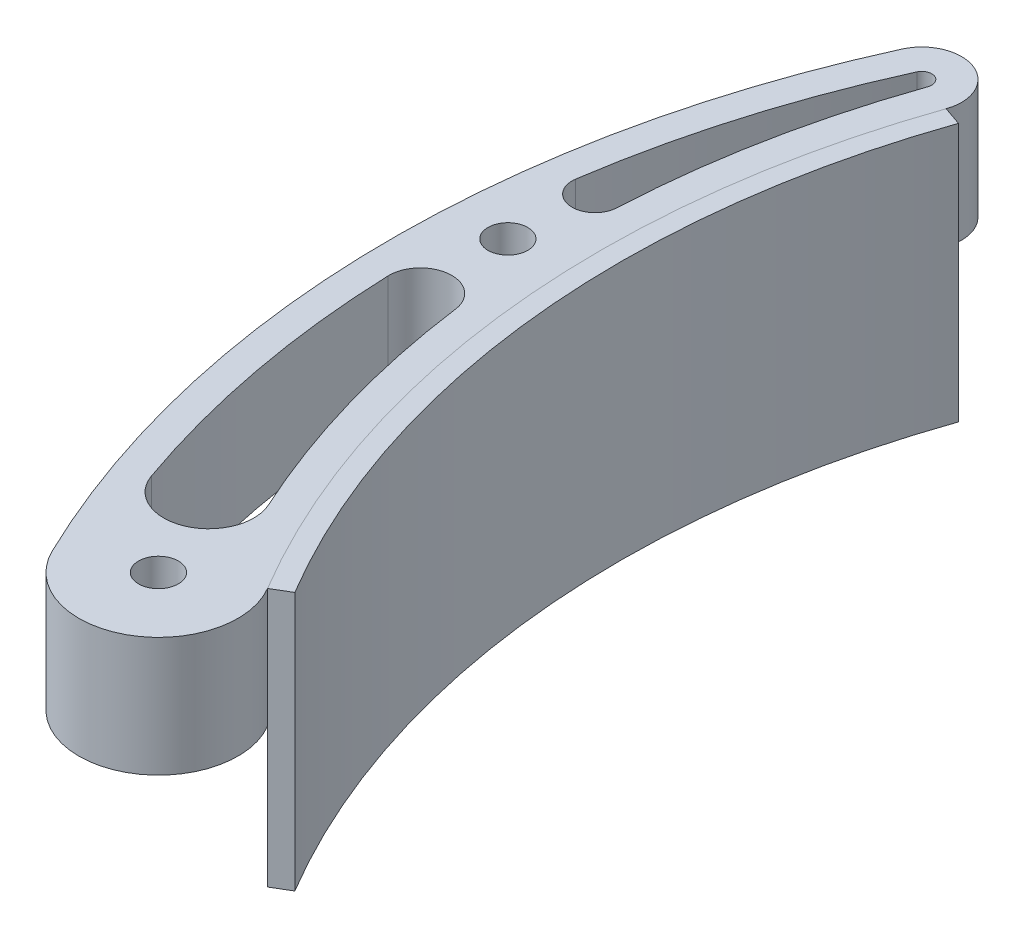
ISO-10303-21;
HEADER;
FILE_DESCRIPTION(('STEP AP214'),'2;1');
FILE_NAME('part.step','',(''),(''),'','','');
FILE_SCHEMA(('AUTOMOTIVE_DESIGN { 1 0 10303 214 1 1 1 1 }'));
ENDSEC;
DATA;
#1=APPLICATION_CONTEXT('core data for automotive mechanical design processes');
#2=APPLICATION_PROTOCOL_DEFINITION('international standard','automotive_design',2000,#1);
#3=PRODUCT_CONTEXT('',#1,'mechanical');
#4=PRODUCT('Part','Part','',(#3));
#5=PRODUCT_RELATED_PRODUCT_CATEGORY('part','',(#4));
#6=PRODUCT_DEFINITION_FORMATION('','',#4);
#7=PRODUCT_DEFINITION_CONTEXT('part definition',#1,'design');
#8=PRODUCT_DEFINITION('design','',#6,#7);
#9=PRODUCT_DEFINITION_SHAPE('','',#8);
#10=(LENGTH_UNIT() NAMED_UNIT(*) SI_UNIT(.MILLI.,.METRE.));
#11=(NAMED_UNIT(*) PLANE_ANGLE_UNIT() SI_UNIT($,.RADIAN.));
#12=(NAMED_UNIT(*) SI_UNIT($,.STERADIAN.) SOLID_ANGLE_UNIT());
#13=UNCERTAINTY_MEASURE_WITH_UNIT(LENGTH_MEASURE(1.E-05),#10,'distance_accuracy_value','');
#14=(GEOMETRIC_REPRESENTATION_CONTEXT(3) GLOBAL_UNCERTAINTY_ASSIGNED_CONTEXT((#13)) GLOBAL_UNIT_ASSIGNED_CONTEXT((#10,
#11,#12)) REPRESENTATION_CONTEXT('',''));
#15=CARTESIAN_POINT('',(0.,0.,0.));
#16=DIRECTION('',(0.,0.,1.));
#17=DIRECTION('',(1.,0.,0.));
#18=AXIS2_PLACEMENT_3D('',#15,#16,#17);
#19=CARTESIAN_POINT('',(0.,-22.225,0.));
#20=DIRECTION('',(0.,1.,0.));
#21=DIRECTION('',(0.,0.,1.));
#22=AXIS2_PLACEMENT_3D('',#19,#20,#21);
#23=CYLINDRICAL_SURFACE('',#22,143.256);
#24=CARTESIAN_POINT('',(0.,19.05,0.));
#25=DIRECTION('',(0.,1.,0.));
#26=DIRECTION('',(0.,0.,1.));
#27=AXIS2_PLACEMENT_3D('',#24,#25,#26);
#28=CIRCLE('',#27,143.256);
#29=CARTESIAN_POINT('',(-135.252327307706,19.05,-47.2132343082858));
#30=VERTEX_POINT('',#29);
#31=CARTESIAN_POINT('',(-123.105955958198,19.05,73.2612117263844));
#32=VERTEX_POINT('',#31);
#33=EDGE_CURVE('E106',#30,#32,#28,.T.);
#34=ORIENTED_EDGE('',*,*,#33,.F.);
#35=DIRECTION('',(0.,1.,0.));
#36=VECTOR('',#35,1.);
#37=CARTESIAN_POINT('',(-135.252327307706,-22.225,-47.2132343082858));
#38=LINE('',#37,#36);
#39=CARTESIAN_POINT('',(-135.252327307706,-22.225,-47.2132343082858));
#40=VERTEX_POINT('',#39);
#41=EDGE_CURVE('E12',#40,#30,#38,.T.);
#42=ORIENTED_EDGE('',*,*,#41,.F.);
#43=CARTESIAN_POINT('',(0.,-22.225,0.));
#44=DIRECTION('',(0.,1.,0.));
#45=DIRECTION('',(0.,0.,1.));
#46=AXIS2_PLACEMENT_3D('',#43,#44,#45);
#47=CIRCLE('',#46,143.256);
#48=CARTESIAN_POINT('',(-123.105955958198,-22.225,73.2612117263844));
#49=VERTEX_POINT('',#48);
#50=EDGE_CURVE('E100',#40,#49,#47,.T.);
#51=ORIENTED_EDGE('',*,*,#50,.T.);
#52=DIRECTION('',(0.,1.,0.));
#53=VECTOR('',#52,1.);
#54=CARTESIAN_POINT('',(-123.105955958198,-22.225,73.2612117263844));
#55=LINE('',#54,#53);
#56=EDGE_CURVE('E45',#49,#32,#55,.T.);
#57=ORIENTED_EDGE('',*,*,#56,.T.);
#58=EDGE_LOOP('',(#34,#42,#51,#57));
#59=FACE_BOUND('',#58,.T.);
#60=ADVANCED_FACE('F42',(#59),#23,.T.);
#61=CARTESIAN_POINT('',(-135.252327307706,-22.225,-47.2132343082858));
#62=DIRECTION('',(0.329572473811116,0.,-0.944130279413822));
#63=DIRECTION('',(-0.944130279413822,0.,-0.329572473811116));
#64=AXIS2_PLACEMENT_3D('',#61,#62,#63);
#65=PLANE('',#64);
#66=DIRECTION('',(-0.944130279413822,0.,-0.329572473811116));
#67=VECTOR('',#66,1.);
#68=CARTESIAN_POINT('',(-135.252327307706,19.05,-47.2132343082858));
#69=LINE('',#68,#67);
#70=CARTESIAN_POINT('',(-132.254713670567,19.05,-46.1668417039355));
#71=VERTEX_POINT('',#70);
#72=EDGE_CURVE('E102',#71,#30,#69,.T.);
#73=ORIENTED_EDGE('',*,*,#72,.F.);
#74=DIRECTION('',(0.,1.,0.));
#75=VECTOR('',#74,1.);
#76=CARTESIAN_POINT('',(-132.254713670567,-22.225,-46.1668417039355));
#77=LINE('',#76,#75);
#78=CARTESIAN_POINT('',(-132.254713670567,-22.225,-46.1668417039355));
#79=VERTEX_POINT('',#78);
#80=EDGE_CURVE('E51',#79,#71,#77,.T.);
#81=ORIENTED_EDGE('',*,*,#80,.F.);
#82=DIRECTION('',(-0.944130279413822,0.,-0.329572473811116));
#83=VECTOR('',#82,1.);
#84=CARTESIAN_POINT('',(-135.252327307706,-22.225,-47.2132343082858));
#85=LINE('',#84,#83);
#86=EDGE_CURVE('E97',#79,#40,#85,.T.);
#87=ORIENTED_EDGE('',*,*,#86,.T.);
#88=ORIENTED_EDGE('',*,*,#41,.T.);
#89=EDGE_LOOP('',(#73,#81,#87,#88));
#90=FACE_BOUND('',#89,.T.);
#91=ADVANCED_FACE('F116',(#90),#65,.T.);
#92=CARTESIAN_POINT('',(0.,-22.225,0.));
#93=DIRECTION('',(0.,1.,0.));
#94=DIRECTION('',(0.,0.,1.));
#95=AXIS2_PLACEMENT_3D('',#92,#93,#94);
#96=CYLINDRICAL_SURFACE('',#95,140.081);
#97=CARTESIAN_POINT('',(0.,19.05,0.));
#98=DIRECTION('',(0.,-1.,0.));
#99=DIRECTION('',(0.,0.,1.));
#100=AXIS2_PLACEMENT_3D('',#97,#98,#99);
#101=CIRCLE('',#100,140.081);
#102=CARTESIAN_POINT('',(-120.377543813735,19.05,71.6375146579805));
#103=VERTEX_POINT('',#102);
#104=EDGE_CURVE('E92',#103,#71,#101,.T.);
#105=ORIENTED_EDGE('',*,*,#104,.F.);
#106=DIRECTION('',(0.,1.,0.));
#107=VECTOR('',#106,1.);
#108=CARTESIAN_POINT('',(-120.377543813735,-22.225,71.6375146579805));
#109=LINE('',#108,#107);
#110=CARTESIAN_POINT('',(-120.377543813735,-22.225,71.6375146579805));
#111=VERTEX_POINT('',#110);
#112=EDGE_CURVE('E87',#111,#103,#109,.T.);
#113=ORIENTED_EDGE('',*,*,#112,.F.);
#114=CARTESIAN_POINT('',(0.,-22.225,0.));
#115=DIRECTION('',(0.,-1.,0.));
#116=DIRECTION('',(0.,0.,1.));
#117=AXIS2_PLACEMENT_3D('',#114,#115,#116);
#118=CIRCLE('',#117,140.081);
#119=EDGE_CURVE('E90',#111,#79,#118,.T.);
#120=ORIENTED_EDGE('',*,*,#119,.T.);
#121=ORIENTED_EDGE('',*,*,#80,.T.);
#122=EDGE_LOOP('',(#105,#113,#120,#121));
#123=FACE_BOUND('',#122,.T.);
#124=ADVANCED_FACE('F89',(#123),#96,.F.);
#125=CARTESIAN_POINT('',(-123.105955958198,-22.225,73.2612117263844));
#126=DIRECTION('',(0.511400651465803,0.,0.859342407705073));
#127=DIRECTION('',(0.859342407705073,0.,-0.511400651465803));
#128=AXIS2_PLACEMENT_3D('',#125,#126,#127);
#129=PLANE('',#128);
#130=DIRECTION('',(0.859342407705073,0.,-0.511400651465803));
#131=VECTOR('',#130,1.);
#132=CARTESIAN_POINT('',(-123.105955958198,19.05,73.2612117263844));
#133=LINE('',#132,#131);
#134=EDGE_CURVE('E109',#32,#103,#133,.T.);
#135=ORIENTED_EDGE('',*,*,#134,.F.);
#136=ORIENTED_EDGE('',*,*,#56,.F.);
#137=DIRECTION('',(0.859342407705073,0.,-0.511400651465803));
#138=VECTOR('',#137,1.);
#139=CARTESIAN_POINT('',(-123.105955958198,-22.225,73.2612117263844));
#140=LINE('',#139,#138);
#141=EDGE_CURVE('E96',#49,#111,#140,.T.);
#142=ORIENTED_EDGE('',*,*,#141,.T.);
#143=ORIENTED_EDGE('',*,*,#112,.T.);
#144=EDGE_LOOP('',(#135,#136,#142,#143));
#145=FACE_BOUND('',#144,.T.);
#146=ADVANCED_FACE('F99',(#145),#129,.T.);
#147=CARTESIAN_POINT('',(0.,-22.225,0.));
#148=DIRECTION('',(0.,1.,0.));
#149=DIRECTION('',(0.,0.,1.));
#150=AXIS2_PLACEMENT_3D('',#147,#148,#149);
#151=PLANE('',#150);
#152=ORIENTED_EDGE('',*,*,#50,.F.);
#153=ORIENTED_EDGE('',*,*,#86,.F.);
#154=ORIENTED_EDGE('',*,*,#119,.F.);
#155=ORIENTED_EDGE('',*,*,#141,.F.);
#156=EDGE_LOOP('',(#152,#153,#154,#155));
#157=FACE_BOUND('',#156,.T.);
#158=ADVANCED_FACE('F95',(#157),#151,.F.);
#159=CARTESIAN_POINT('',(0.,19.05,0.));
#160=DIRECTION('',(0.,1.,0.));
#161=DIRECTION('',(0.,0.,1.));
#162=AXIS2_PLACEMENT_3D('',#159,#160,#161);
#163=PLANE('',#162);
#164=ORIENTED_EDGE('',*,*,#33,.T.);
#165=ORIENTED_EDGE('',*,*,#134,.T.);
#166=ORIENTED_EDGE('',*,*,#104,.T.);
#167=ORIENTED_EDGE('',*,*,#72,.T.);
#168=EDGE_LOOP('',(#164,#165,#166,#167));
#169=FACE_BOUND('',#168,.T.);
#170=ADVANCED_FACE('F115',(#169),#163,.T.);
#171=CLOSED_SHELL('',(#60,#91,#124,#146,#158,#170));
#172=MANIFOLD_SOLID_BREP('B2',#171);
#173=CARTESIAN_POINT('',(-70.623777290992,19.05,-24.6530097584931));
#174=DIRECTION('',(0.,-1.,0.));
#175=DIRECTION('',(0.,0.,-1.));
#176=AXIS2_PLACEMENT_3D('',#173,#174,#175);
#177=PLANE('',#176);
#178=CARTESIAN_POINT('',(-141.119521250419,19.05,64.6207132746109));
#179=DIRECTION('',(0.,1.,0.));
#180=DIRECTION('',(0.,0.,1.));
#181=AXIS2_PLACEMENT_3D('',#178,#179,#180);
#182=CIRCLE('',#181,7.19282646191411);
#183=CARTESIAN_POINT('',(-147.905040723107,19.05,67.0068142777081));
#184=VERTEX_POINT('',#183);
#185=CARTESIAN_POINT('',(-134.579739329338,19.05,61.6260505330136));
#186=VERTEX_POINT('',#185);
#187=EDGE_CURVE('E281',#184,#186,#182,.T.);
#188=ORIENTED_EDGE('',*,*,#187,.F.);
#189=CARTESIAN_POINT('',(6.10622663543836E-13,19.05,14.9965934754486));
#190=DIRECTION('',(0.,1.,0.));
#191=DIRECTION('',(0.,0.,1.));
#192=AXIS2_PLACEMENT_3D('',#189,#190,#191);
#193=CIRCLE('',#192,156.783175561678);
#194=CARTESIAN_POINT('',(-156.687709885089,19.05,20.4670331442535));
#195=VERTEX_POINT('',#194);
#196=EDGE_CURVE('E180',#195,#184,#193,.T.);
#197=ORIENTED_EDGE('',*,*,#196,.F.);
#198=CARTESIAN_POINT('',(-151.678950888903,19.05,20.2921622885603));
#199=DIRECTION('',(0.,1.,0.));
#200=DIRECTION('',(0.,0.,-1.));
#201=AXIS2_PLACEMENT_3D('',#198,#199,#200);
#202=CIRCLE('',#201,5.01181070053919);
#203=CARTESIAN_POINT('',(-146.711397822902,19.05,19.6275849533296));
#204=VERTEX_POINT('',#203);
#205=EDGE_CURVE('E272',#204,#195,#202,.T.);
#206=ORIENTED_EDGE('',*,*,#205,.F.);
#207=CARTESIAN_POINT('',(0.,19.05,0.));
#208=DIRECTION('',(0.,-1.,0.));
#209=DIRECTION('',(0.,0.,1.));
#210=AXIS2_PLACEMENT_3D('',#207,#208,#209);
#211=CIRCLE('',#210,148.0185);
#212=EDGE_CURVE('E275',#186,#204,#211,.T.);
#213=ORIENTED_EDGE('',*,*,#212,.F.);
#214=EDGE_LOOP('',(#188,#197,#206,#213));
#215=FACE_BOUND('',#214,.T.);
#216=CARTESIAN_POINT('',(-141.247554581984,19.05,-49.3060195169864));
#217=DIRECTION('',(0.,1.,0.));
#218=DIRECTION('',(0.,0.,-1.));
#219=AXIS2_PLACEMENT_3D('',#216,#217,#218);
#220=CIRCLE('',#219,1.58749999999998);
#221=CARTESIAN_POINT('',(-139.748747763415,19.05,-48.7828232148112));
#222=VERTEX_POINT('',#221);
#223=CARTESIAN_POINT('',(-142.692378943793,19.05,-49.9637723683853));
#224=VERTEX_POINT('',#223);
#225=EDGE_CURVE('E306',#222,#224,#220,.T.);
#226=ORIENTED_EDGE('',*,*,#225,.F.);
#227=CARTESIAN_POINT('',(0.,19.05,0.));
#228=DIRECTION('',(0.,-1.,0.));
#229=DIRECTION('',(0.,0.,1.));
#230=AXIS2_PLACEMENT_3D('',#227,#228,#229);
#231=CIRCLE('',#230,148.0185);
#232=CARTESIAN_POINT('',(-147.842813364416,19.05,-7.20963790661359));
#233=VERTEX_POINT('',#232);
#234=EDGE_CURVE('E287',#233,#222,#231,.T.);
#235=ORIENTED_EDGE('',*,*,#234,.F.);
#236=CARTESIAN_POINT('',(-151.48842462343,19.05,-7.38741818911525));
#237=DIRECTION('',(0.,1.,0.));
#238=DIRECTION('',(0.,0.,-1.));
#239=AXIS2_PLACEMENT_3D('',#236,#237,#238);
#240=CIRCLE('',#239,3.64994346267139);
#241=CARTESIAN_POINT('',(-155.099163961624,19.05,-7.92094298920967));
#242=VERTEX_POINT('',#241);
#243=EDGE_CURVE('E295',#242,#233,#240,.T.);
#244=ORIENTED_EDGE('',*,*,#243,.F.);
#245=CARTESIAN_POINT('',(6.10622663543836E-13,19.05,14.9965934754486));
#246=DIRECTION('',(0.,1.,0.));
#247=DIRECTION('',(0.,0.,1.));
#248=AXIS2_PLACEMENT_3D('',#245,#246,#247);
#249=CIRCLE('',#248,156.783175561678);
#250=EDGE_CURVE('E309',#224,#242,#249,.T.);
#251=ORIENTED_EDGE('',*,*,#250,.F.);
#252=EDGE_LOOP('',(#226,#235,#244,#251));
#253=FACE_BOUND('',#252,.T.);
#254=CARTESIAN_POINT('',(-141.247554581984,19.05,-49.3060195169863));
#255=DIRECTION('',(0.,1.,0.));
#256=DIRECTION('',(0.,0.,-1.));
#257=AXIS2_PLACEMENT_3D('',#254,#255,#256);
#258=CIRCLE('',#257,6.34999999999998);
#259=CARTESIAN_POINT('',(-135.252327307706,19.05,-47.2132343082858));
#260=VERTEX_POINT('',#259);
#261=CARTESIAN_POINT('',(-147.02685202922,19.05,-51.9370309225823));
#262=VERTEX_POINT('',#261);
#263=EDGE_CURVE('E335',#260,#262,#258,.T.);
#264=ORIENTED_EDGE('',*,*,#263,.T.);
#265=CARTESIAN_POINT('',(6.10622663543836E-13,19.05,14.9965934754486));
#266=DIRECTION('',(0.,1.,0.));
#267=DIRECTION('',(0.,0.,-1.));
#268=AXIS2_PLACEMENT_3D('',#265,#266,#267);
#269=CIRCLE('',#268,161.545675561678);
#270=CARTESIAN_POINT('',(-145.454595651415,19.05,85.2814844304899));
#271=VERTEX_POINT('',#270);
#272=EDGE_CURVE('E338',#262,#271,#269,.T.);
#273=ORIENTED_EDGE('',*,*,#272,.T.);
#274=CARTESIAN_POINT('',(-134.019604536053,19.05,79.756));
#275=DIRECTION('',(0.,1.,0.));
#276=DIRECTION('',(0.,0.,-1.));
#277=AXIS2_PLACEMENT_3D('',#274,#275,#276);
#278=CIRCLE('',#277,12.7);
#279=CARTESIAN_POINT('',(-123.105955958198,19.05,73.2612117263844));
#280=VERTEX_POINT('',#279);
#281=EDGE_CURVE('E341',#271,#280,#278,.T.);
#282=ORIENTED_EDGE('',*,*,#281,.T.);
#283=CARTESIAN_POINT('',(0.,19.05,0.));
#284=DIRECTION('',(0.,-1.,0.));
#285=DIRECTION('',(0.,0.,1.));
#286=AXIS2_PLACEMENT_3D('',#283,#284,#285);
#287=CIRCLE('',#286,143.256);
#288=EDGE_CURVE('E343',#280,#260,#287,.T.);
#289=ORIENTED_EDGE('',*,*,#288,.T.);
#290=EDGE_LOOP('',(#264,#273,#282,#289));
#291=FACE_BOUND('',#290,.T.);
#292=CARTESIAN_POINT('',(-134.019604536053,19.05,79.756));
#293=DIRECTION('',(0.,1.,0.));
#294=DIRECTION('',(0.,0.,1.));
#295=AXIS2_PLACEMENT_3D('',#292,#293,#294);
#296=CIRCLE('',#295,3.17499999999997);
#297=CARTESIAN_POINT('',(-134.019604536053,19.05,82.931));
#298=VERTEX_POINT('',#297);
#299=EDGE_CURVE('E329',#298,#298,#296,.T.);
#300=ORIENTED_EDGE('',*,*,#299,.F.);
#301=EDGE_LOOP('',(#300));
#302=FACE_BOUND('',#301,.T.);
#303=CARTESIAN_POINT('',(-152.238831544355,19.05,5.76613740234445));
#304=DIRECTION('',(0.,1.,0.));
#305=DIRECTION('',(0.,0.,1.));
#306=AXIS2_PLACEMENT_3D('',#303,#304,#305);
#307=CIRCLE('',#306,3.175);
#308=CARTESIAN_POINT('',(-152.238831544355,19.05,8.94113740234445));
#309=VERTEX_POINT('',#308);
#310=EDGE_CURVE('E323',#309,#309,#307,.T.);
#311=ORIENTED_EDGE('',*,*,#310,.F.);
#312=EDGE_LOOP('',(#311));
#313=FACE_BOUND('',#312,.T.);
#314=ADVANCED_FACE('F165',(#215,#253,#291,#302,#313),#177,.F.);
#315=CARTESIAN_POINT('',(-70.623777290992,0.,-24.6530097584931));
#316=DIRECTION('',(0.,-1.,0.));
#317=DIRECTION('',(0.,0.,-1.));
#318=AXIS2_PLACEMENT_3D('',#315,#316,#317);
#319=PLANE('',#318);
#320=CARTESIAN_POINT('',(6.10622663543836E-13,0.,14.9965934754486));
#321=DIRECTION('',(0.,1.,0.));
#322=DIRECTION('',(0.,0.,1.));
#323=AXIS2_PLACEMENT_3D('',#320,#321,#322);
#324=CIRCLE('',#323,156.783175561678);
#325=CARTESIAN_POINT('',(-156.687709885089,0.,20.4670331442535));
#326=VERTEX_POINT('',#325);
#327=CARTESIAN_POINT('',(-147.905040723107,0.,67.0068142777081));
#328=VERTEX_POINT('',#327);
#329=EDGE_CURVE('E256',#326,#328,#324,.T.);
#330=ORIENTED_EDGE('',*,*,#329,.T.);
#331=CARTESIAN_POINT('',(-141.119521250419,0.,64.6207132746109));
#332=DIRECTION('',(0.,1.,0.));
#333=DIRECTION('',(0.,0.,1.));
#334=AXIS2_PLACEMENT_3D('',#331,#332,#333);
#335=CIRCLE('',#334,7.19282646191411);
#336=CARTESIAN_POINT('',(-134.579739329338,0.,61.6260505330136));
#337=VERTEX_POINT('',#336);
#338=EDGE_CURVE('E265',#328,#337,#335,.T.);
#339=ORIENTED_EDGE('',*,*,#338,.T.);
#340=CARTESIAN_POINT('',(0.,0.,0.));
#341=DIRECTION('',(0.,-1.,0.));
#342=DIRECTION('',(0.,0.,1.));
#343=AXIS2_PLACEMENT_3D('',#340,#341,#342);
#344=CIRCLE('',#343,148.0185);
#345=CARTESIAN_POINT('',(-146.711397822902,0.,19.6275849533296));
#346=VERTEX_POINT('',#345);
#347=EDGE_CURVE('E188',#337,#346,#344,.T.);
#348=ORIENTED_EDGE('',*,*,#347,.T.);
#349=CARTESIAN_POINT('',(-151.678950888903,0.,20.2921622885603));
#350=DIRECTION('',(0.,1.,0.));
#351=DIRECTION('',(0.,0.,-1.));
#352=AXIS2_PLACEMENT_3D('',#349,#350,#351);
#353=CIRCLE('',#352,5.01181070053919);
#354=EDGE_CURVE('E262',#346,#326,#353,.T.);
#355=ORIENTED_EDGE('',*,*,#354,.T.);
#356=EDGE_LOOP('',(#330,#339,#348,#355));
#357=FACE_BOUND('',#356,.T.);
#358=CARTESIAN_POINT('',(0.,0.,0.));
#359=DIRECTION('',(0.,-1.,0.));
#360=DIRECTION('',(0.,0.,1.));
#361=AXIS2_PLACEMENT_3D('',#358,#359,#360);
#362=CIRCLE('',#361,148.0185);
#363=CARTESIAN_POINT('',(-147.842813364416,0.,-7.20963790661359));
#364=VERTEX_POINT('',#363);
#365=CARTESIAN_POINT('',(-139.748747763415,0.,-48.7828232148112));
#366=VERTEX_POINT('',#365);
#367=EDGE_CURVE('E291',#364,#366,#362,.T.);
#368=ORIENTED_EDGE('',*,*,#367,.T.);
#369=CARTESIAN_POINT('',(-141.247554581984,0.,-49.3060195169864));
#370=DIRECTION('',(0.,1.,0.));
#371=DIRECTION('',(0.,0.,-1.));
#372=AXIS2_PLACEMENT_3D('',#369,#370,#371);
#373=CIRCLE('',#372,1.58749999999998);
#374=CARTESIAN_POINT('',(-142.692378943793,0.,-49.9637723683853));
#375=VERTEX_POINT('',#374);
#376=EDGE_CURVE('E294',#366,#375,#373,.T.);
#377=ORIENTED_EDGE('',*,*,#376,.T.);
#378=CARTESIAN_POINT('',(6.10622663543836E-13,0.,14.9965934754486));
#379=DIRECTION('',(0.,1.,0.));
#380=DIRECTION('',(0.,0.,1.));
#381=AXIS2_PLACEMENT_3D('',#378,#379,#380);
#382=CIRCLE('',#381,156.783175561678);
#383=CARTESIAN_POINT('',(-155.099163961624,0.,-7.92094298920967));
#384=VERTEX_POINT('',#383);
#385=EDGE_CURVE('E298',#375,#384,#382,.T.);
#386=ORIENTED_EDGE('',*,*,#385,.T.);
#387=CARTESIAN_POINT('',(-151.48842462343,0.,-7.38741818911525));
#388=DIRECTION('',(0.,1.,0.));
#389=DIRECTION('',(0.,0.,-1.));
#390=AXIS2_PLACEMENT_3D('',#387,#388,#389);
#391=CIRCLE('',#390,3.64994346267139);
#392=EDGE_CURVE('E301',#384,#364,#391,.T.);
#393=ORIENTED_EDGE('',*,*,#392,.T.);
#394=EDGE_LOOP('',(#368,#377,#386,#393));
#395=FACE_BOUND('',#394,.T.);
#396=CARTESIAN_POINT('',(-134.019604536053,0.,79.756));
#397=DIRECTION('',(0.,1.,0.));
#398=DIRECTION('',(0.,0.,1.));
#399=AXIS2_PLACEMENT_3D('',#396,#397,#398);
#400=CIRCLE('',#399,3.17499999999997);
#401=CARTESIAN_POINT('',(-134.019604536053,0.,82.931));
#402=VERTEX_POINT('',#401);
#403=EDGE_CURVE('E326',#402,#402,#400,.T.);
#404=ORIENTED_EDGE('',*,*,#403,.T.);
#405=EDGE_LOOP('',(#404));
#406=FACE_BOUND('',#405,.T.);
#407=CARTESIAN_POINT('',(-141.247554581984,0.,-49.3060195169863));
#408=DIRECTION('',(0.,1.,0.));
#409=DIRECTION('',(0.,0.,-1.));
#410=AXIS2_PLACEMENT_3D('',#407,#408,#409);
#411=CIRCLE('',#410,6.34999999999998);
#412=CARTESIAN_POINT('',(-135.252327307706,0.,-47.2132343082858));
#413=VERTEX_POINT('',#412);
#414=CARTESIAN_POINT('',(-147.02685202922,0.,-51.9370309225823));
#415=VERTEX_POINT('',#414);
#416=EDGE_CURVE('E332',#413,#415,#411,.T.);
#417=ORIENTED_EDGE('',*,*,#416,.F.);
#418=CARTESIAN_POINT('',(0.,0.,0.));
#419=DIRECTION('',(0.,-1.,0.));
#420=DIRECTION('',(0.,0.,1.));
#421=AXIS2_PLACEMENT_3D('',#418,#419,#420);
#422=CIRCLE('',#421,143.256);
#423=CARTESIAN_POINT('',(-123.105955958198,0.,73.2612117263844));
#424=VERTEX_POINT('',#423);
#425=EDGE_CURVE('E339',#424,#413,#422,.T.);
#426=ORIENTED_EDGE('',*,*,#425,.F.);
#427=CARTESIAN_POINT('',(-134.019604536053,0.,79.756));
#428=DIRECTION('',(0.,1.,0.));
#429=DIRECTION('',(0.,0.,-1.));
#430=AXIS2_PLACEMENT_3D('',#427,#428,#429);
#431=CIRCLE('',#430,12.7);
#432=CARTESIAN_POINT('',(-145.454595651415,0.,85.2814844304899));
#433=VERTEX_POINT('',#432);
#434=EDGE_CURVE('E350',#433,#424,#431,.T.);
#435=ORIENTED_EDGE('',*,*,#434,.F.);
#436=CARTESIAN_POINT('',(6.10622663543836E-13,0.,14.9965934754486));
#437=DIRECTION('',(0.,1.,0.));
#438=DIRECTION('',(0.,0.,-1.));
#439=AXIS2_PLACEMENT_3D('',#436,#437,#438);
#440=CIRCLE('',#439,161.545675561678);
#441=EDGE_CURVE('E348',#415,#433,#440,.T.);
#442=ORIENTED_EDGE('',*,*,#441,.F.);
#443=EDGE_LOOP('',(#417,#426,#435,#442));
#444=FACE_BOUND('',#443,.T.);
#445=CARTESIAN_POINT('',(-152.238831544355,0.,5.76613740234445));
#446=DIRECTION('',(0.,1.,0.));
#447=DIRECTION('',(0.,0.,1.));
#448=AXIS2_PLACEMENT_3D('',#445,#446,#447);
#449=CIRCLE('',#448,3.175);
#450=CARTESIAN_POINT('',(-152.238831544355,0.,8.94113740234445));
#451=VERTEX_POINT('',#450);
#452=EDGE_CURVE('E316',#451,#451,#449,.T.);
#453=ORIENTED_EDGE('',*,*,#452,.T.);
#454=EDGE_LOOP('',(#453));
#455=FACE_BOUND('',#454,.T.);
#456=ADVANCED_FACE('F269',(#357,#395,#406,#444,#455),#319,.T.);
#457=CARTESIAN_POINT('',(-141.247554581984,19.05,-49.3060195169863));
#458=DIRECTION('',(0.,-1.,0.));
#459=DIRECTION('',(0.,0.,-1.));
#460=AXIS2_PLACEMENT_3D('',#457,#458,#459);
#461=CYLINDRICAL_SURFACE('',#460,6.34999999999998);
#462=ORIENTED_EDGE('',*,*,#416,.T.);
#463=DIRECTION('',(0.,-1.,0.));
#464=VECTOR('',#463,1.);
#465=CARTESIAN_POINT('',(-147.02685202922,19.05,-51.9370309225823));
#466=LINE('',#465,#464);
#467=EDGE_CURVE('E40',#262,#415,#466,.T.);
#468=ORIENTED_EDGE('',*,*,#467,.F.);
#469=ORIENTED_EDGE('',*,*,#263,.F.);
#470=DIRECTION('',(0.,-1.,0.));
#471=VECTOR('',#470,1.);
#472=CARTESIAN_POINT('',(-135.252327307706,19.05,-47.2132343082858));
#473=LINE('',#472,#471);
#474=EDGE_CURVE('E345',#260,#413,#473,.T.);
#475=ORIENTED_EDGE('',*,*,#474,.T.);
#476=EDGE_LOOP('',(#462,#468,#469,#475));
#477=FACE_BOUND('',#476,.T.);
#478=ADVANCED_FACE('F167',(#477),#461,.T.);
#479=CARTESIAN_POINT('',(6.10622663543836E-13,19.05,14.9965934754486));
#480=DIRECTION('',(0.,-1.,0.));
#481=DIRECTION('',(0.,0.,-1.));
#482=AXIS2_PLACEMENT_3D('',#479,#480,#481);
#483=CYLINDRICAL_SURFACE('',#482,161.545675561678);
#484=ORIENTED_EDGE('',*,*,#441,.T.);
#485=DIRECTION('',(0.,-1.,0.));
#486=VECTOR('',#485,1.);
#487=CARTESIAN_POINT('',(-145.454595651415,19.05,85.2814844304899));
#488=LINE('',#487,#486);
#489=EDGE_CURVE('E173',#271,#433,#488,.T.);
#490=ORIENTED_EDGE('',*,*,#489,.F.);
#491=ORIENTED_EDGE('',*,*,#272,.F.);
#492=ORIENTED_EDGE('',*,*,#467,.T.);
#493=EDGE_LOOP('',(#484,#490,#491,#492));
#494=FACE_BOUND('',#493,.T.);
#495=ADVANCED_FACE('F378',(#494),#483,.T.);
#496=CARTESIAN_POINT('',(-134.019604536053,19.05,79.756));
#497=DIRECTION('',(0.,-1.,0.));
#498=DIRECTION('',(0.,0.,-1.));
#499=AXIS2_PLACEMENT_3D('',#496,#497,#498);
#500=CYLINDRICAL_SURFACE('',#499,12.7);
#501=ORIENTED_EDGE('',*,*,#434,.T.);
#502=DIRECTION('',(0.,-1.,0.));
#503=VECTOR('',#502,1.);
#504=CARTESIAN_POINT('',(-123.105955958198,19.05,73.2612117263844));
#505=LINE('',#504,#503);
#506=EDGE_CURVE('E355',#280,#424,#505,.T.);
#507=ORIENTED_EDGE('',*,*,#506,.F.);
#508=ORIENTED_EDGE('',*,*,#281,.F.);
#509=ORIENTED_EDGE('',*,*,#489,.T.);
#510=EDGE_LOOP('',(#501,#507,#508,#509));
#511=FACE_BOUND('',#510,.T.);
#512=ADVANCED_FACE('F362',(#511),#500,.T.);
#513=CARTESIAN_POINT('',(0.,19.05,0.));
#514=DIRECTION('',(0.,-1.,0.));
#515=DIRECTION('',(0.,0.,-1.));
#516=AXIS2_PLACEMENT_3D('',#513,#514,#515);
#517=CYLINDRICAL_SURFACE('',#516,143.256);
#518=ORIENTED_EDGE('',*,*,#425,.T.);
#519=ORIENTED_EDGE('',*,*,#474,.F.);
#520=ORIENTED_EDGE('',*,*,#288,.F.);
#521=ORIENTED_EDGE('',*,*,#506,.T.);
#522=EDGE_LOOP('',(#518,#519,#520,#521));
#523=FACE_BOUND('',#522,.T.);
#524=ADVANCED_FACE('F371',(#523),#517,.F.);
#525=CARTESIAN_POINT('',(-134.019604536053,19.05,79.756));
#526=DIRECTION('',(0.,-1.,0.));
#527=DIRECTION('',(0.,0.,-1.));
#528=AXIS2_PLACEMENT_3D('',#525,#526,#527);
#529=CYLINDRICAL_SURFACE('',#528,3.17499999999997);
#530=ORIENTED_EDGE('',*,*,#299,.T.);
#531=EDGE_LOOP('',(#530));
#532=FACE_BOUND('',#531,.T.);
#533=ORIENTED_EDGE('',*,*,#403,.F.);
#534=EDGE_LOOP('',(#533));
#535=FACE_BOUND('',#534,.T.);
#536=ADVANCED_FACE('F394',(#532,#535),#529,.F.);
#537=CARTESIAN_POINT('',(-152.238831544355,19.05,5.76613740234445));
#538=DIRECTION('',(0.,-1.,0.));
#539=DIRECTION('',(0.,0.,-1.));
#540=AXIS2_PLACEMENT_3D('',#537,#538,#539);
#541=CYLINDRICAL_SURFACE('',#540,3.175);
#542=ORIENTED_EDGE('',*,*,#310,.T.);
#543=EDGE_LOOP('',(#542));
#544=FACE_BOUND('',#543,.T.);
#545=ORIENTED_EDGE('',*,*,#452,.F.);
#546=EDGE_LOOP('',(#545));
#547=FACE_BOUND('',#546,.T.);
#548=ADVANCED_FACE('F401',(#544,#547),#541,.F.);
#549=CARTESIAN_POINT('',(0.,0.,0.));
#550=DIRECTION('',(0.,1.,0.));
#551=DIRECTION('',(0.,0.,1.));
#552=AXIS2_PLACEMENT_3D('',#549,#550,#551);
#553=CYLINDRICAL_SURFACE('',#552,148.0185);
#554=ORIENTED_EDGE('',*,*,#234,.T.);
#555=DIRECTION('',(0.,1.,0.));
#556=VECTOR('',#555,1.);
#557=CARTESIAN_POINT('',(-139.748747763415,0.,-48.7828232148112));
#558=LINE('',#557,#556);
#559=EDGE_CURVE('E304',#366,#222,#558,.T.);
#560=ORIENTED_EDGE('',*,*,#559,.F.);
#561=ORIENTED_EDGE('',*,*,#367,.F.);
#562=DIRECTION('',(0.,1.,0.));
#563=VECTOR('',#562,1.);
#564=CARTESIAN_POINT('',(-147.842813364416,0.,-7.20963790661359));
#565=LINE('',#564,#563);
#566=EDGE_CURVE('E314',#364,#233,#565,.T.);
#567=ORIENTED_EDGE('',*,*,#566,.T.);
#568=EDGE_LOOP('',(#554,#560,#561,#567));
#569=FACE_BOUND('',#568,.T.);
#570=ADVANCED_FACE('F406',(#569),#553,.T.);
#571=CARTESIAN_POINT('',(-151.48842462343,0.,-7.38741818911525));
#572=DIRECTION('',(0.,1.,0.));
#573=DIRECTION('',(0.,0.,1.));
#574=AXIS2_PLACEMENT_3D('',#571,#572,#573);
#575=CYLINDRICAL_SURFACE('',#574,3.64994346267139);
#576=ORIENTED_EDGE('',*,*,#243,.T.);
#577=ORIENTED_EDGE('',*,*,#566,.F.);
#578=ORIENTED_EDGE('',*,*,#392,.F.);
#579=DIRECTION('',(0.,1.,0.));
#580=VECTOR('',#579,1.);
#581=CARTESIAN_POINT('',(-155.099163961624,0.,-7.92094298920967));
#582=LINE('',#581,#580);
#583=EDGE_CURVE('E317',#384,#242,#582,.T.);
#584=ORIENTED_EDGE('',*,*,#583,.T.);
#585=EDGE_LOOP('',(#576,#577,#578,#584));
#586=FACE_BOUND('',#585,.T.);
#587=ADVANCED_FACE('F419',(#586),#575,.F.);
#588=CARTESIAN_POINT('',(6.10622663543836E-13,0.,14.9965934754486));
#589=DIRECTION('',(0.,1.,0.));
#590=DIRECTION('',(0.,0.,1.));
#591=AXIS2_PLACEMENT_3D('',#588,#589,#590);
#592=CYLINDRICAL_SURFACE('',#591,156.783175561678);
#593=ORIENTED_EDGE('',*,*,#250,.T.);
#594=ORIENTED_EDGE('',*,*,#583,.F.);
#595=ORIENTED_EDGE('',*,*,#385,.F.);
#596=DIRECTION('',(0.,1.,0.));
#597=VECTOR('',#596,1.);
#598=CARTESIAN_POINT('',(-142.692378943793,0.,-49.9637723683853));
#599=LINE('',#598,#597);
#600=EDGE_CURVE('E319',#375,#224,#599,.T.);
#601=ORIENTED_EDGE('',*,*,#600,.T.);
#602=EDGE_LOOP('',(#593,#594,#595,#601));
#603=FACE_BOUND('',#602,.T.);
#604=ADVANCED_FACE('F426',(#603),#592,.F.);
#605=CARTESIAN_POINT('',(-141.247554581984,0.,-49.3060195169864));
#606=DIRECTION('',(0.,1.,0.));
#607=DIRECTION('',(0.,0.,1.));
#608=AXIS2_PLACEMENT_3D('',#605,#606,#607);
#609=CYLINDRICAL_SURFACE('',#608,1.58749999999998);
#610=ORIENTED_EDGE('',*,*,#225,.T.);
#611=ORIENTED_EDGE('',*,*,#600,.F.);
#612=ORIENTED_EDGE('',*,*,#376,.F.);
#613=ORIENTED_EDGE('',*,*,#559,.T.);
#614=EDGE_LOOP('',(#610,#611,#612,#613));
#615=FACE_BOUND('',#614,.T.);
#616=ADVANCED_FACE('F423',(#615),#609,.F.);
#617=CARTESIAN_POINT('',(6.10622663543836E-13,0.,14.9965934754486));
#618=DIRECTION('',(0.,1.,0.));
#619=DIRECTION('',(0.,0.,1.));
#620=AXIS2_PLACEMENT_3D('',#617,#618,#619);
#621=CYLINDRICAL_SURFACE('',#620,156.783175561678);
#622=ORIENTED_EDGE('',*,*,#196,.T.);
#623=DIRECTION('',(0.,1.,0.));
#624=VECTOR('',#623,1.);
#625=CARTESIAN_POINT('',(-147.905040723107,0.,67.0068142777081));
#626=LINE('',#625,#624);
#627=EDGE_CURVE('E252',#328,#184,#626,.T.);
#628=ORIENTED_EDGE('',*,*,#627,.F.);
#629=ORIENTED_EDGE('',*,*,#329,.F.);
#630=DIRECTION('',(0.,1.,0.));
#631=VECTOR('',#630,1.);
#632=CARTESIAN_POINT('',(-156.687709885089,0.,20.4670331442535));
#633=LINE('',#632,#631);
#634=EDGE_CURVE('E285',#326,#195,#633,.T.);
#635=ORIENTED_EDGE('',*,*,#634,.T.);
#636=EDGE_LOOP('',(#622,#628,#629,#635));
#637=FACE_BOUND('',#636,.T.);
#638=ADVANCED_FACE('F254',(#637),#621,.F.);
#639=CARTESIAN_POINT('',(-151.678950888903,0.,20.2921622885603));
#640=DIRECTION('',(0.,1.,0.));
#641=DIRECTION('',(0.,0.,1.));
#642=AXIS2_PLACEMENT_3D('',#639,#640,#641);
#643=CYLINDRICAL_SURFACE('',#642,5.01181070053919);
#644=ORIENTED_EDGE('',*,*,#205,.T.);
#645=ORIENTED_EDGE('',*,*,#634,.F.);
#646=ORIENTED_EDGE('',*,*,#354,.F.);
#647=DIRECTION('',(0.,1.,0.));
#648=VECTOR('',#647,1.);
#649=CARTESIAN_POINT('',(-146.711397822902,0.,19.6275849533296));
#650=LINE('',#649,#648);
#651=EDGE_CURVE('E288',#346,#204,#650,.T.);
#652=ORIENTED_EDGE('',*,*,#651,.T.);
#653=EDGE_LOOP('',(#644,#645,#646,#652));
#654=FACE_BOUND('',#653,.T.);
#655=ADVANCED_FACE('F436',(#654),#643,.F.);
#656=CARTESIAN_POINT('',(0.,0.,0.));
#657=DIRECTION('',(0.,1.,0.));
#658=DIRECTION('',(0.,0.,1.));
#659=AXIS2_PLACEMENT_3D('',#656,#657,#658);
#660=CYLINDRICAL_SURFACE('',#659,148.0185);
#661=ORIENTED_EDGE('',*,*,#212,.T.);
#662=ORIENTED_EDGE('',*,*,#651,.F.);
#663=ORIENTED_EDGE('',*,*,#347,.F.);
#664=DIRECTION('',(0.,1.,0.));
#665=VECTOR('',#664,1.);
#666=CARTESIAN_POINT('',(-134.579739329338,0.,61.6260505330136));
#667=LINE('',#666,#665);
#668=EDGE_CURVE('E261',#337,#186,#667,.T.);
#669=ORIENTED_EDGE('',*,*,#668,.T.);
#670=EDGE_LOOP('',(#661,#662,#663,#669));
#671=FACE_BOUND('',#670,.T.);
#672=ADVANCED_FACE('F439',(#671),#660,.T.);
#673=CARTESIAN_POINT('',(-141.119521250419,0.,64.6207132746109));
#674=DIRECTION('',(0.,1.,0.));
#675=DIRECTION('',(0.,0.,1.));
#676=AXIS2_PLACEMENT_3D('',#673,#674,#675);
#677=CYLINDRICAL_SURFACE('',#676,7.19282646191411);
#678=ORIENTED_EDGE('',*,*,#187,.T.);
#679=ORIENTED_EDGE('',*,*,#668,.F.);
#680=ORIENTED_EDGE('',*,*,#338,.F.);
#681=ORIENTED_EDGE('',*,*,#627,.T.);
#682=EDGE_LOOP('',(#678,#679,#680,#681));
#683=FACE_BOUND('',#682,.T.);
#684=ADVANCED_FACE('F266',(#683),#677,.F.);
#685=CLOSED_SHELL('',(#314,#456,#478,#495,#512,#524,#536,#548,#570,#587,#604,#616,#638,#655,
#672,#684));
#686=MANIFOLD_SOLID_BREP('B6',#685);
#687=ADVANCED_BREP_SHAPE_REPRESENTATION('',(#18,#172,#686),#14);
#688=SHAPE_DEFINITION_REPRESENTATION(#9,#687);
ENDSEC;
END-ISO-10303-21;
